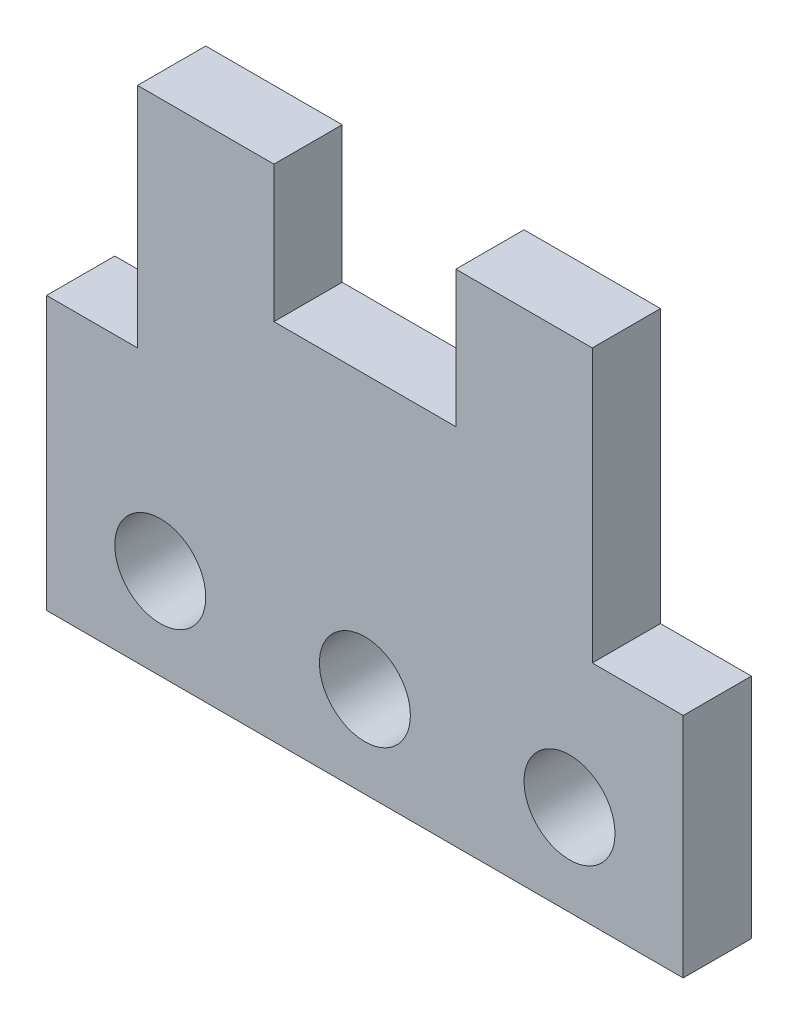
ISO-10303-21;
HEADER;
FILE_DESCRIPTION(('STEP AP214'),'2;1');
FILE_NAME('part.step','',(''),(''),'','','');
FILE_SCHEMA(('AUTOMOTIVE_DESIGN { 1 0 10303 214 1 1 1 1 }'));
ENDSEC;
DATA;
#1=APPLICATION_CONTEXT('core data for automotive mechanical design processes');
#2=APPLICATION_PROTOCOL_DEFINITION('international standard','automotive_design',2000,#1);
#3=PRODUCT_CONTEXT('',#1,'mechanical');
#4=PRODUCT('Part','Part','',(#3));
#5=PRODUCT_RELATED_PRODUCT_CATEGORY('part','',(#4));
#6=PRODUCT_DEFINITION_FORMATION('','',#4);
#7=PRODUCT_DEFINITION_CONTEXT('part definition',#1,'design');
#8=PRODUCT_DEFINITION('design','',#6,#7);
#9=PRODUCT_DEFINITION_SHAPE('','',#8);
#10=(LENGTH_UNIT() NAMED_UNIT(*) SI_UNIT(.MILLI.,.METRE.));
#11=(NAMED_UNIT(*) PLANE_ANGLE_UNIT() SI_UNIT($,.RADIAN.));
#12=(NAMED_UNIT(*) SI_UNIT($,.STERADIAN.) SOLID_ANGLE_UNIT());
#13=UNCERTAINTY_MEASURE_WITH_UNIT(LENGTH_MEASURE(1.E-05),#10,'distance_accuracy_value','');
#14=(GEOMETRIC_REPRESENTATION_CONTEXT(3) GLOBAL_UNCERTAINTY_ASSIGNED_CONTEXT((#13)) GLOBAL_UNIT_ASSIGNED_CONTEXT((#10,
#11,#12)) REPRESENTATION_CONTEXT('',''));
#15=CARTESIAN_POINT('',(0.,0.,0.));
#16=DIRECTION('',(0.,0.,1.));
#17=DIRECTION('',(1.,0.,0.));
#18=AXIS2_PLACEMENT_3D('',#15,#16,#17);
#19=CARTESIAN_POINT('',(0.,0.,15.));
#20=DIRECTION('',(0.,0.,1.));
#21=DIRECTION('',(1.,0.,0.));
#22=AXIS2_PLACEMENT_3D('',#19,#20,#21);
#23=PLANE('',#22);
#24=CARTESIAN_POINT('',(0.,-20.1911074126129,15.));
#25=DIRECTION('',(0.,0.,1.));
#26=DIRECTION('',(1.,0.,0.));
#27=AXIS2_PLACEMENT_3D('',#24,#25,#26);
#28=CIRCLE('',#27,10.);
#29=CARTESIAN_POINT('',(10.,-20.1911074126129,15.));
#30=VERTEX_POINT('',#29);
#31=EDGE_CURVE('E327',#30,#30,#28,.T.);
#32=ORIENTED_EDGE('',*,*,#31,.F.);
#33=EDGE_LOOP('',(#32));
#34=FACE_BOUND('',#33,.T.);
#35=DIRECTION('',(1.,0.,0.));
#36=VECTOR('',#35,1.);
#37=CARTESIAN_POINT('',(-70.,-40.1911074126129,15.));
#38=LINE('',#37,#36);
#39=CARTESIAN_POINT('',(-70.,-40.1911074126129,15.));
#40=VERTEX_POINT('',#39);
#41=CARTESIAN_POINT('',(70.,-40.1911074126129,15.));
#42=VERTEX_POINT('',#41);
#43=EDGE_CURVE('E200',#40,#42,#38,.T.);
#44=ORIENTED_EDGE('',*,*,#43,.T.);
#45=DIRECTION('',(0.,1.,0.));
#46=VECTOR('',#45,1.);
#47=CARTESIAN_POINT('',(70.,-40.1911074126129,15.));
#48=LINE('',#47,#46);
#49=CARTESIAN_POINT('',(70.,9.80889258738708,15.));
#50=VERTEX_POINT('',#49);
#51=EDGE_CURVE('E112',#42,#50,#48,.T.);
#52=ORIENTED_EDGE('',*,*,#51,.T.);
#53=DIRECTION('',(-1.,0.,0.));
#54=VECTOR('',#53,1.);
#55=CARTESIAN_POINT('',(70.,9.80889258738708,15.));
#56=LINE('',#55,#54);
#57=CARTESIAN_POINT('',(50.,9.80889258738707,15.));
#58=VERTEX_POINT('',#57);
#59=EDGE_CURVE('E237',#50,#58,#56,.T.);
#60=ORIENTED_EDGE('',*,*,#59,.T.);
#61=DIRECTION('',(0.,1.,0.));
#62=VECTOR('',#61,1.);
#63=CARTESIAN_POINT('',(50.,9.80889258738707,15.));
#64=LINE('',#63,#62);
#65=CARTESIAN_POINT('',(50.,69.8088925873871,15.));
#66=VERTEX_POINT('',#65);
#67=EDGE_CURVE('E257',#58,#66,#64,.T.);
#68=ORIENTED_EDGE('',*,*,#67,.T.);
#69=DIRECTION('',(-1.,0.,0.));
#70=VECTOR('',#69,1.);
#71=CARTESIAN_POINT('',(50.,69.8088925873871,15.));
#72=LINE('',#71,#70);
#73=CARTESIAN_POINT('',(20.,69.8088925873871,15.));
#74=VERTEX_POINT('',#73);
#75=EDGE_CURVE('E253',#66,#74,#72,.T.);
#76=ORIENTED_EDGE('',*,*,#75,.T.);
#77=DIRECTION('',(0.,-1.,0.));
#78=VECTOR('',#77,1.);
#79=CARTESIAN_POINT('',(20.,69.8088925873871,15.));
#80=LINE('',#79,#78);
#81=CARTESIAN_POINT('',(20.,39.8088925873871,15.));
#82=VERTEX_POINT('',#81);
#83=EDGE_CURVE('E256',#74,#82,#80,.T.);
#84=ORIENTED_EDGE('',*,*,#83,.T.);
#85=DIRECTION('',(-1.,0.,0.));
#86=VECTOR('',#85,1.);
#87=CARTESIAN_POINT('',(20.,39.8088925873871,15.));
#88=LINE('',#87,#86);
#89=CARTESIAN_POINT('',(-20.,39.8088925873871,15.));
#90=VERTEX_POINT('',#89);
#91=EDGE_CURVE('E261',#82,#90,#88,.T.);
#92=ORIENTED_EDGE('',*,*,#91,.T.);
#93=DIRECTION('',(0.,1.,0.));
#94=VECTOR('',#93,1.);
#95=CARTESIAN_POINT('',(-20.,39.8088925873871,15.));
#96=LINE('',#95,#94);
#97=CARTESIAN_POINT('',(-20.,69.8088925873871,15.));
#98=VERTEX_POINT('',#97);
#99=EDGE_CURVE('E268',#90,#98,#96,.T.);
#100=ORIENTED_EDGE('',*,*,#99,.T.);
#101=DIRECTION('',(-1.,0.,0.));
#102=VECTOR('',#101,1.);
#103=CARTESIAN_POINT('',(-20.,69.8088925873871,15.));
#104=LINE('',#103,#102);
#105=CARTESIAN_POINT('',(-50.,69.8088925873871,15.));
#106=VERTEX_POINT('',#105);
#107=EDGE_CURVE('E143',#98,#106,#104,.T.);
#108=ORIENTED_EDGE('',*,*,#107,.T.);
#109=DIRECTION('',(0.,-1.,0.));
#110=VECTOR('',#109,1.);
#111=CARTESIAN_POINT('',(-50.,69.8088925873871,15.));
#112=LINE('',#111,#110);
#113=CARTESIAN_POINT('',(-50.,19.8088925873871,15.));
#114=VERTEX_POINT('',#113);
#115=EDGE_CURVE('E137',#106,#114,#112,.T.);
#116=ORIENTED_EDGE('',*,*,#115,.T.);
#117=DIRECTION('',(-1.,0.,0.));
#118=VECTOR('',#117,1.);
#119=CARTESIAN_POINT('',(-50.,19.8088925873871,15.));
#120=LINE('',#119,#118);
#121=CARTESIAN_POINT('',(-70.,19.8088925873871,15.));
#122=VERTEX_POINT('',#121);
#123=EDGE_CURVE('E141',#114,#122,#120,.T.);
#124=ORIENTED_EDGE('',*,*,#123,.T.);
#125=DIRECTION('',(0.,-1.,0.));
#126=VECTOR('',#125,1.);
#127=CARTESIAN_POINT('',(-70.,19.8088925873871,15.));
#128=LINE('',#127,#126);
#129=EDGE_CURVE('E57',#122,#40,#128,.T.);
#130=ORIENTED_EDGE('',*,*,#129,.T.);
#131=EDGE_LOOP('',(#44,#52,#60,#68,#76,#84,#92,#100,#108,#116,#124,#130));
#132=FACE_BOUND('',#131,.T.);
#133=CARTESIAN_POINT('',(-45.,-20.1911074126129,15.));
#134=DIRECTION('',(0.,0.,1.));
#135=DIRECTION('',(1.,0.,0.));
#136=AXIS2_PLACEMENT_3D('',#133,#134,#135);
#137=CIRCLE('',#136,10.);
#138=CARTESIAN_POINT('',(-35.,-20.1911074126129,15.));
#139=VERTEX_POINT('',#138);
#140=EDGE_CURVE('E170',#139,#139,#137,.T.);
#141=ORIENTED_EDGE('',*,*,#140,.F.);
#142=EDGE_LOOP('',(#141));
#143=FACE_BOUND('',#142,.T.);
#144=CARTESIAN_POINT('',(45.,-20.1911074126129,15.));
#145=DIRECTION('',(0.,0.,1.));
#146=DIRECTION('',(1.,0.,0.));
#147=AXIS2_PLACEMENT_3D('',#144,#145,#146);
#148=CIRCLE('',#147,10.);
#149=CARTESIAN_POINT('',(55.,-20.1911074126129,15.));
#150=VERTEX_POINT('',#149);
#151=EDGE_CURVE('E316',#150,#150,#148,.T.);
#152=ORIENTED_EDGE('',*,*,#151,.F.);
#153=EDGE_LOOP('',(#152));
#154=FACE_BOUND('',#153,.T.);
#155=ADVANCED_FACE('F39',(#34,#132,#143,#154),#23,.T.);
#156=CARTESIAN_POINT('',(0.,0.,0.));
#157=DIRECTION('',(0.,0.,1.));
#158=DIRECTION('',(1.,0.,0.));
#159=AXIS2_PLACEMENT_3D('',#156,#157,#158);
#160=PLANE('',#159);
#161=DIRECTION('',(1.,0.,0.));
#162=VECTOR('',#161,1.);
#163=CARTESIAN_POINT('',(-70.,-40.1911074126129,0.));
#164=LINE('',#163,#162);
#165=CARTESIAN_POINT('',(-70.,-40.1911074126129,0.));
#166=VERTEX_POINT('',#165);
#167=CARTESIAN_POINT('',(70.,-40.1911074126129,0.));
#168=VERTEX_POINT('',#167);
#169=EDGE_CURVE('E165',#166,#168,#164,.T.);
#170=ORIENTED_EDGE('',*,*,#169,.F.);
#171=DIRECTION('',(0.,-1.,0.));
#172=VECTOR('',#171,1.);
#173=CARTESIAN_POINT('',(-70.,19.8088925873871,0.));
#174=LINE('',#173,#172);
#175=CARTESIAN_POINT('',(-70.,19.8088925873871,0.));
#176=VERTEX_POINT('',#175);
#177=EDGE_CURVE('E104',#176,#166,#174,.T.);
#178=ORIENTED_EDGE('',*,*,#177,.F.);
#179=DIRECTION('',(-1.,0.,0.));
#180=VECTOR('',#179,1.);
#181=CARTESIAN_POINT('',(-50.,19.8088925873871,0.));
#182=LINE('',#181,#180);
#183=CARTESIAN_POINT('',(-50.,19.8088925873871,0.));
#184=VERTEX_POINT('',#183);
#185=EDGE_CURVE('E98',#184,#176,#182,.T.);
#186=ORIENTED_EDGE('',*,*,#185,.F.);
#187=DIRECTION('',(0.,-1.,0.));
#188=VECTOR('',#187,1.);
#189=CARTESIAN_POINT('',(-50.,69.8088925873871,0.));
#190=LINE('',#189,#188);
#191=CARTESIAN_POINT('',(-50.,69.8088925873871,0.));
#192=VERTEX_POINT('',#191);
#193=EDGE_CURVE('E152',#192,#184,#190,.T.);
#194=ORIENTED_EDGE('',*,*,#193,.F.);
#195=DIRECTION('',(-1.,0.,0.));
#196=VECTOR('',#195,1.);
#197=CARTESIAN_POINT('',(-20.,69.8088925873871,0.));
#198=LINE('',#197,#196);
#199=CARTESIAN_POINT('',(-20.,69.8088925873871,0.));
#200=VERTEX_POINT('',#199);
#201=EDGE_CURVE('E191',#200,#192,#198,.T.);
#202=ORIENTED_EDGE('',*,*,#201,.F.);
#203=DIRECTION('',(0.,1.,0.));
#204=VECTOR('',#203,1.);
#205=CARTESIAN_POINT('',(-20.,39.8088925873871,0.));
#206=LINE('',#205,#204);
#207=CARTESIAN_POINT('',(-20.,39.8088925873871,0.));
#208=VERTEX_POINT('',#207);
#209=EDGE_CURVE('E188',#208,#200,#206,.T.);
#210=ORIENTED_EDGE('',*,*,#209,.F.);
#211=DIRECTION('',(-1.,0.,0.));
#212=VECTOR('',#211,1.);
#213=CARTESIAN_POINT('',(20.,39.8088925873871,0.));
#214=LINE('',#213,#212);
#215=CARTESIAN_POINT('',(20.,39.8088925873871,0.));
#216=VERTEX_POINT('',#215);
#217=EDGE_CURVE('E185',#216,#208,#214,.T.);
#218=ORIENTED_EDGE('',*,*,#217,.F.);
#219=DIRECTION('',(0.,-1.,0.));
#220=VECTOR('',#219,1.);
#221=CARTESIAN_POINT('',(20.,69.8088925873871,0.));
#222=LINE('',#221,#220);
#223=CARTESIAN_POINT('',(20.,69.8088925873871,0.));
#224=VERTEX_POINT('',#223);
#225=EDGE_CURVE('E182',#224,#216,#222,.T.);
#226=ORIENTED_EDGE('',*,*,#225,.F.);
#227=DIRECTION('',(-1.,0.,0.));
#228=VECTOR('',#227,1.);
#229=CARTESIAN_POINT('',(50.,69.8088925873871,0.));
#230=LINE('',#229,#228);
#231=CARTESIAN_POINT('',(50.,69.8088925873871,0.));
#232=VERTEX_POINT('',#231);
#233=EDGE_CURVE('E179',#232,#224,#230,.T.);
#234=ORIENTED_EDGE('',*,*,#233,.F.);
#235=DIRECTION('',(0.,1.,0.));
#236=VECTOR('',#235,1.);
#237=CARTESIAN_POINT('',(50.,9.80889258738707,0.));
#238=LINE('',#237,#236);
#239=CARTESIAN_POINT('',(50.,9.80889258738707,0.));
#240=VERTEX_POINT('',#239);
#241=EDGE_CURVE('E176',#240,#232,#238,.T.);
#242=ORIENTED_EDGE('',*,*,#241,.F.);
#243=DIRECTION('',(-1.,0.,0.));
#244=VECTOR('',#243,1.);
#245=CARTESIAN_POINT('',(70.,9.80889258738708,0.));
#246=LINE('',#245,#244);
#247=CARTESIAN_POINT('',(70.,9.80889258738708,0.));
#248=VERTEX_POINT('',#247);
#249=EDGE_CURVE('E173',#248,#240,#246,.T.);
#250=ORIENTED_EDGE('',*,*,#249,.F.);
#251=DIRECTION('',(0.,1.,0.));
#252=VECTOR('',#251,1.);
#253=CARTESIAN_POINT('',(70.,-40.1911074126129,0.));
#254=LINE('',#253,#252);
#255=EDGE_CURVE('E169',#168,#248,#254,.T.);
#256=ORIENTED_EDGE('',*,*,#255,.F.);
#257=EDGE_LOOP('',(#170,#178,#186,#194,#202,#210,#218,#226,#234,#242,#250,#256));
#258=FACE_BOUND('',#257,.T.);
#259=CARTESIAN_POINT('',(-45.,-20.1911074126129,0.));
#260=DIRECTION('',(0.,0.,1.));
#261=DIRECTION('',(1.,0.,0.));
#262=AXIS2_PLACEMENT_3D('',#259,#260,#261);
#263=CIRCLE('',#262,10.);
#264=CARTESIAN_POINT('',(-35.,-20.1911074126129,0.));
#265=VERTEX_POINT('',#264);
#266=EDGE_CURVE('E331',#265,#265,#263,.T.);
#267=ORIENTED_EDGE('',*,*,#266,.T.);
#268=EDGE_LOOP('',(#267));
#269=FACE_BOUND('',#268,.T.);
#270=CARTESIAN_POINT('',(0.,-20.1911074126129,0.));
#271=DIRECTION('',(0.,0.,1.));
#272=DIRECTION('',(1.,0.,0.));
#273=AXIS2_PLACEMENT_3D('',#270,#271,#272);
#274=CIRCLE('',#273,10.);
#275=CARTESIAN_POINT('',(10.,-20.1911074126129,0.));
#276=VERTEX_POINT('',#275);
#277=EDGE_CURVE('E324',#276,#276,#274,.T.);
#278=ORIENTED_EDGE('',*,*,#277,.T.);
#279=EDGE_LOOP('',(#278));
#280=FACE_BOUND('',#279,.T.);
#281=CARTESIAN_POINT('',(45.,-20.1911074126129,0.));
#282=DIRECTION('',(0.,0.,1.));
#283=DIRECTION('',(1.,0.,0.));
#284=AXIS2_PLACEMENT_3D('',#281,#282,#283);
#285=CIRCLE('',#284,10.);
#286=CARTESIAN_POINT('',(55.,-20.1911074126129,0.));
#287=VERTEX_POINT('',#286);
#288=EDGE_CURVE('E319',#287,#287,#285,.T.);
#289=ORIENTED_EDGE('',*,*,#288,.T.);
#290=EDGE_LOOP('',(#289));
#291=FACE_BOUND('',#290,.T.);
#292=ADVANCED_FACE('F241',(#258,#269,#280,#291),#160,.F.);
#293=CARTESIAN_POINT('',(-70.,-40.1911074126129,15.));
#294=DIRECTION('',(0.,1.,0.));
#295=DIRECTION('',(0.,0.,1.));
#296=AXIS2_PLACEMENT_3D('',#293,#294,#295);
#297=PLANE('',#296);
#298=ORIENTED_EDGE('',*,*,#169,.T.);
#299=DIRECTION('',(0.,0.,-1.));
#300=VECTOR('',#299,1.);
#301=CARTESIAN_POINT('',(70.,-40.1911074126129,15.));
#302=LINE('',#301,#300);
#303=EDGE_CURVE('E11',#42,#168,#302,.T.);
#304=ORIENTED_EDGE('',*,*,#303,.F.);
#305=ORIENTED_EDGE('',*,*,#43,.F.);
#306=DIRECTION('',(0.,0.,-1.));
#307=VECTOR('',#306,1.);
#308=CARTESIAN_POINT('',(-70.,-40.1911074126129,15.));
#309=LINE('',#308,#307);
#310=EDGE_CURVE('E161',#40,#166,#309,.T.);
#311=ORIENTED_EDGE('',*,*,#310,.T.);
#312=EDGE_LOOP('',(#298,#304,#305,#311));
#313=FACE_BOUND('',#312,.T.);
#314=ADVANCED_FACE('F41',(#313),#297,.F.);
#315=CARTESIAN_POINT('',(70.,-40.1911074126129,15.));
#316=DIRECTION('',(-1.,0.,0.));
#317=DIRECTION('',(0.,-1.,0.));
#318=AXIS2_PLACEMENT_3D('',#315,#316,#317);
#319=PLANE('',#318);
#320=ORIENTED_EDGE('',*,*,#255,.T.);
#321=DIRECTION('',(0.,0.,-1.));
#322=VECTOR('',#321,1.);
#323=CARTESIAN_POINT('',(70.,9.80889258738708,15.));
#324=LINE('',#323,#322);
#325=EDGE_CURVE('E49',#50,#248,#324,.T.);
#326=ORIENTED_EDGE('',*,*,#325,.F.);
#327=ORIENTED_EDGE('',*,*,#51,.F.);
#328=ORIENTED_EDGE('',*,*,#303,.T.);
#329=EDGE_LOOP('',(#320,#326,#327,#328));
#330=FACE_BOUND('',#329,.T.);
#331=ADVANCED_FACE('F439',(#330),#319,.F.);
#332=CARTESIAN_POINT('',(70.,9.80889258738708,15.));
#333=DIRECTION('',(0.,-1.,0.));
#334=DIRECTION('',(1.,0.,0.));
#335=AXIS2_PLACEMENT_3D('',#332,#333,#334);
#336=PLANE('',#335);
#337=ORIENTED_EDGE('',*,*,#249,.T.);
#338=DIRECTION('',(0.,0.,-1.));
#339=VECTOR('',#338,1.);
#340=CARTESIAN_POINT('',(50.,9.80889258738707,15.));
#341=LINE('',#340,#339);
#342=EDGE_CURVE('E227',#58,#240,#341,.T.);
#343=ORIENTED_EDGE('',*,*,#342,.F.);
#344=ORIENTED_EDGE('',*,*,#59,.F.);
#345=ORIENTED_EDGE('',*,*,#325,.T.);
#346=EDGE_LOOP('',(#337,#343,#344,#345));
#347=FACE_BOUND('',#346,.T.);
#348=ADVANCED_FACE('F235',(#347),#336,.F.);
#349=CARTESIAN_POINT('',(50.,9.80889258738707,15.));
#350=DIRECTION('',(-1.,0.,0.));
#351=DIRECTION('',(0.,0.,1.));
#352=AXIS2_PLACEMENT_3D('',#349,#350,#351);
#353=PLANE('',#352);
#354=ORIENTED_EDGE('',*,*,#241,.T.);
#355=DIRECTION('',(0.,0.,-1.));
#356=VECTOR('',#355,1.);
#357=CARTESIAN_POINT('',(50.,69.8088925873871,15.));
#358=LINE('',#357,#356);
#359=EDGE_CURVE('E223',#66,#232,#358,.T.);
#360=ORIENTED_EDGE('',*,*,#359,.F.);
#361=ORIENTED_EDGE('',*,*,#67,.F.);
#362=ORIENTED_EDGE('',*,*,#342,.T.);
#363=EDGE_LOOP('',(#354,#360,#361,#362));
#364=FACE_BOUND('',#363,.T.);
#365=ADVANCED_FACE('F247',(#364),#353,.F.);
#366=CARTESIAN_POINT('',(50.,69.8088925873871,15.));
#367=DIRECTION('',(0.,-1.,0.));
#368=DIRECTION('',(1.,0.,0.));
#369=AXIS2_PLACEMENT_3D('',#366,#367,#368);
#370=PLANE('',#369);
#371=ORIENTED_EDGE('',*,*,#233,.T.);
#372=DIRECTION('',(0.,0.,-1.));
#373=VECTOR('',#372,1.);
#374=CARTESIAN_POINT('',(20.,69.8088925873871,15.));
#375=LINE('',#374,#373);
#376=EDGE_CURVE('E219',#74,#224,#375,.T.);
#377=ORIENTED_EDGE('',*,*,#376,.F.);
#378=ORIENTED_EDGE('',*,*,#75,.F.);
#379=ORIENTED_EDGE('',*,*,#359,.T.);
#380=EDGE_LOOP('',(#371,#377,#378,#379));
#381=FACE_BOUND('',#380,.T.);
#382=ADVANCED_FACE('F251',(#381),#370,.F.);
#383=CARTESIAN_POINT('',(20.,69.8088925873871,15.));
#384=DIRECTION('',(1.,0.,0.));
#385=DIRECTION('',(0.,1.,0.));
#386=AXIS2_PLACEMENT_3D('',#383,#384,#385);
#387=PLANE('',#386);
#388=ORIENTED_EDGE('',*,*,#225,.T.);
#389=DIRECTION('',(0.,0.,-1.));
#390=VECTOR('',#389,1.);
#391=CARTESIAN_POINT('',(20.,39.8088925873871,15.));
#392=LINE('',#391,#390);
#393=EDGE_CURVE('E215',#82,#216,#392,.T.);
#394=ORIENTED_EDGE('',*,*,#393,.F.);
#395=ORIENTED_EDGE('',*,*,#83,.F.);
#396=ORIENTED_EDGE('',*,*,#376,.T.);
#397=EDGE_LOOP('',(#388,#394,#395,#396));
#398=FACE_BOUND('',#397,.T.);
#399=ADVANCED_FACE('F404',(#398),#387,.F.);
#400=CARTESIAN_POINT('',(20.,39.8088925873871,15.));
#401=DIRECTION('',(0.,-1.,0.));
#402=DIRECTION('',(1.,0.,0.));
#403=AXIS2_PLACEMENT_3D('',#400,#401,#402);
#404=PLANE('',#403);
#405=ORIENTED_EDGE('',*,*,#217,.T.);
#406=DIRECTION('',(0.,0.,-1.));
#407=VECTOR('',#406,1.);
#408=CARTESIAN_POINT('',(-20.,39.8088925873871,15.));
#409=LINE('',#408,#407);
#410=EDGE_CURVE('E211',#90,#208,#409,.T.);
#411=ORIENTED_EDGE('',*,*,#410,.F.);
#412=ORIENTED_EDGE('',*,*,#91,.F.);
#413=ORIENTED_EDGE('',*,*,#393,.T.);
#414=EDGE_LOOP('',(#405,#411,#412,#413));
#415=FACE_BOUND('',#414,.T.);
#416=ADVANCED_FACE('F395',(#415),#404,.F.);
#417=CARTESIAN_POINT('',(-20.,39.8088925873871,15.));
#418=DIRECTION('',(-1.,0.,0.));
#419=DIRECTION('',(0.,-1.,0.));
#420=AXIS2_PLACEMENT_3D('',#417,#418,#419);
#421=PLANE('',#420);
#422=ORIENTED_EDGE('',*,*,#209,.T.);
#423=DIRECTION('',(0.,0.,-1.));
#424=VECTOR('',#423,1.);
#425=CARTESIAN_POINT('',(-20.,69.8088925873871,15.));
#426=LINE('',#425,#424);
#427=EDGE_CURVE('E207',#98,#200,#426,.T.);
#428=ORIENTED_EDGE('',*,*,#427,.F.);
#429=ORIENTED_EDGE('',*,*,#99,.F.);
#430=ORIENTED_EDGE('',*,*,#410,.T.);
#431=EDGE_LOOP('',(#422,#428,#429,#430));
#432=FACE_BOUND('',#431,.T.);
#433=ADVANCED_FACE('F276',(#432),#421,.F.);
#434=CARTESIAN_POINT('',(-20.,69.8088925873871,15.));
#435=DIRECTION('',(0.,-1.,0.));
#436=DIRECTION('',(1.,0.,0.));
#437=AXIS2_PLACEMENT_3D('',#434,#435,#436);
#438=PLANE('',#437);
#439=ORIENTED_EDGE('',*,*,#201,.T.);
#440=DIRECTION('',(0.,0.,-1.));
#441=VECTOR('',#440,1.);
#442=CARTESIAN_POINT('',(-50.,69.8088925873871,15.));
#443=LINE('',#442,#441);
#444=EDGE_CURVE('E154',#106,#192,#443,.T.);
#445=ORIENTED_EDGE('',*,*,#444,.F.);
#446=ORIENTED_EDGE('',*,*,#107,.F.);
#447=ORIENTED_EDGE('',*,*,#427,.T.);
#448=EDGE_LOOP('',(#439,#445,#446,#447));
#449=FACE_BOUND('',#448,.T.);
#450=ADVANCED_FACE('F280',(#449),#438,.F.);
#451=CARTESIAN_POINT('',(-50.,69.8088925873871,15.));
#452=DIRECTION('',(1.,0.,0.));
#453=DIRECTION('',(0.,1.,0.));
#454=AXIS2_PLACEMENT_3D('',#451,#452,#453);
#455=PLANE('',#454);
#456=ORIENTED_EDGE('',*,*,#193,.T.);
#457=DIRECTION('',(0.,0.,-1.));
#458=VECTOR('',#457,1.);
#459=CARTESIAN_POINT('',(-50.,19.8088925873871,15.));
#460=LINE('',#459,#458);
#461=EDGE_CURVE('E149',#114,#184,#460,.T.);
#462=ORIENTED_EDGE('',*,*,#461,.F.);
#463=ORIENTED_EDGE('',*,*,#115,.F.);
#464=ORIENTED_EDGE('',*,*,#444,.T.);
#465=EDGE_LOOP('',(#456,#462,#463,#464));
#466=FACE_BOUND('',#465,.T.);
#467=ADVANCED_FACE('F150',(#466),#455,.F.);
#468=CARTESIAN_POINT('',(-50.,19.8088925873871,15.));
#469=DIRECTION('',(0.,-1.,0.));
#470=DIRECTION('',(0.,0.,-1.));
#471=AXIS2_PLACEMENT_3D('',#468,#469,#470);
#472=PLANE('',#471);
#473=ORIENTED_EDGE('',*,*,#185,.T.);
#474=DIRECTION('',(0.,0.,-1.));
#475=VECTOR('',#474,1.);
#476=CARTESIAN_POINT('',(-70.,19.8088925873871,15.));
#477=LINE('',#476,#475);
#478=EDGE_CURVE('E155',#122,#176,#477,.T.);
#479=ORIENTED_EDGE('',*,*,#478,.F.);
#480=ORIENTED_EDGE('',*,*,#123,.F.);
#481=ORIENTED_EDGE('',*,*,#461,.T.);
#482=EDGE_LOOP('',(#473,#479,#480,#481));
#483=FACE_BOUND('',#482,.T.);
#484=ADVANCED_FACE('F157',(#483),#472,.F.);
#485=CARTESIAN_POINT('',(-70.,19.8088925873871,15.));
#486=DIRECTION('',(1.,0.,0.));
#487=DIRECTION('',(0.,0.,-1.));
#488=AXIS2_PLACEMENT_3D('',#485,#486,#487);
#489=PLANE('',#488);
#490=ORIENTED_EDGE('',*,*,#177,.T.);
#491=ORIENTED_EDGE('',*,*,#310,.F.);
#492=ORIENTED_EDGE('',*,*,#129,.F.);
#493=ORIENTED_EDGE('',*,*,#478,.T.);
#494=EDGE_LOOP('',(#490,#491,#492,#493));
#495=FACE_BOUND('',#494,.T.);
#496=ADVANCED_FACE('F284',(#495),#489,.F.);
#497=CARTESIAN_POINT('',(-45.,-20.1911074126129,15.));
#498=DIRECTION('',(0.,0.,-1.));
#499=DIRECTION('',(-1.,0.,0.));
#500=AXIS2_PLACEMENT_3D('',#497,#498,#499);
#501=CYLINDRICAL_SURFACE('',#500,10.);
#502=ORIENTED_EDGE('',*,*,#140,.T.);
#503=EDGE_LOOP('',(#502));
#504=FACE_BOUND('',#503,.T.);
#505=ORIENTED_EDGE('',*,*,#266,.F.);
#506=EDGE_LOOP('',(#505));
#507=FACE_BOUND('',#506,.T.);
#508=ADVANCED_FACE('F286',(#504,#507),#501,.F.);
#509=CARTESIAN_POINT('',(0.,-20.1911074126129,15.));
#510=DIRECTION('',(0.,0.,-1.));
#511=DIRECTION('',(-1.,0.,0.));
#512=AXIS2_PLACEMENT_3D('',#509,#510,#511);
#513=CYLINDRICAL_SURFACE('',#512,10.);
#514=ORIENTED_EDGE('',*,*,#31,.T.);
#515=EDGE_LOOP('',(#514));
#516=FACE_BOUND('',#515,.T.);
#517=ORIENTED_EDGE('',*,*,#277,.F.);
#518=EDGE_LOOP('',(#517));
#519=FACE_BOUND('',#518,.T.);
#520=ADVANCED_FACE('F292',(#516,#519),#513,.F.);
#521=CARTESIAN_POINT('',(45.,-20.1911074126129,15.));
#522=DIRECTION('',(0.,0.,-1.));
#523=DIRECTION('',(-1.,0.,0.));
#524=AXIS2_PLACEMENT_3D('',#521,#522,#523);
#525=CYLINDRICAL_SURFACE('',#524,10.);
#526=ORIENTED_EDGE('',*,*,#151,.T.);
#527=EDGE_LOOP('',(#526));
#528=FACE_BOUND('',#527,.T.);
#529=ORIENTED_EDGE('',*,*,#288,.F.);
#530=EDGE_LOOP('',(#529));
#531=FACE_BOUND('',#530,.T.);
#532=ADVANCED_FACE('F307',(#528,#531),#525,.F.);
#533=CLOSED_SHELL('',(#155,#292,#314,#331,#348,#365,#382,#399,#416,#433,#450,#467,#484,#496,
#508,#520,#532));
#534=MANIFOLD_SOLID_BREP('B2',#533);
#535=ADVANCED_BREP_SHAPE_REPRESENTATION('',(#18,#534),#14);
#536=SHAPE_DEFINITION_REPRESENTATION(#9,#535);
ENDSEC;
END-ISO-10303-21;
